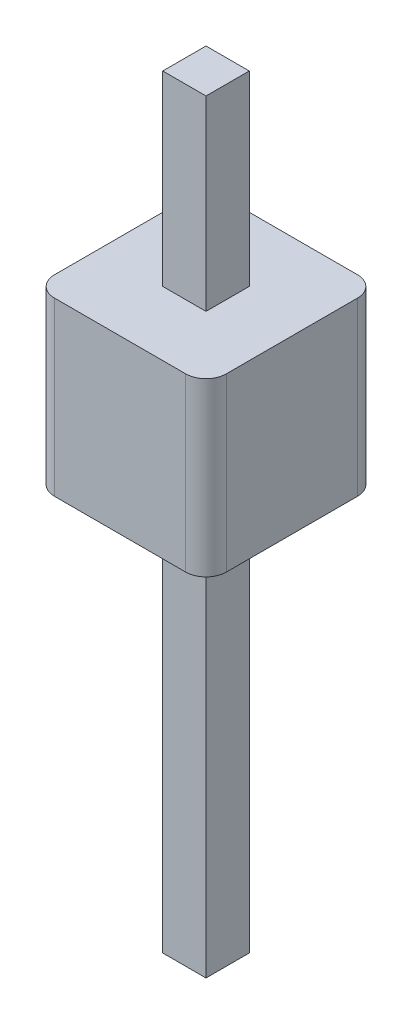
ISO-10303-21;
HEADER;
FILE_DESCRIPTION(('STEP AP214'),'2;1');
FILE_NAME('part.step','',(''),(''),'','','');
FILE_SCHEMA(('AUTOMOTIVE_DESIGN { 1 0 10303 214 1 1 1 1 }'));
ENDSEC;
DATA;
#1=APPLICATION_CONTEXT('core data for automotive mechanical design processes');
#2=APPLICATION_PROTOCOL_DEFINITION('international standard','automotive_design',2000,#1);
#3=PRODUCT_CONTEXT('',#1,'mechanical');
#4=PRODUCT('Part','Part','',(#3));
#5=PRODUCT_RELATED_PRODUCT_CATEGORY('part','',(#4));
#6=PRODUCT_DEFINITION_FORMATION('','',#4);
#7=PRODUCT_DEFINITION_CONTEXT('part definition',#1,'design');
#8=PRODUCT_DEFINITION('design','',#6,#7);
#9=PRODUCT_DEFINITION_SHAPE('','',#8);
#10=(LENGTH_UNIT() NAMED_UNIT(*) SI_UNIT(.MILLI.,.METRE.));
#11=(NAMED_UNIT(*) PLANE_ANGLE_UNIT() SI_UNIT($,.RADIAN.));
#12=(NAMED_UNIT(*) SI_UNIT($,.STERADIAN.) SOLID_ANGLE_UNIT());
#13=UNCERTAINTY_MEASURE_WITH_UNIT(LENGTH_MEASURE(1.E-05),#10,'distance_accuracy_value','');
#14=(GEOMETRIC_REPRESENTATION_CONTEXT(3) GLOBAL_UNCERTAINTY_ASSIGNED_CONTEXT((#13)) GLOBAL_UNIT_ASSIGNED_CONTEXT((#10,
#11,#12)) REPRESENTATION_CONTEXT('',''));
#15=CARTESIAN_POINT('',(0.,0.,0.));
#16=DIRECTION('',(0.,0.,1.));
#17=DIRECTION('',(1.,0.,0.));
#18=AXIS2_PLACEMENT_3D('',#15,#16,#17);
#19=CARTESIAN_POINT('',(-0.97,2.54,0.97));
#20=DIRECTION('',(0.,-1.,0.));
#21=DIRECTION('',(0.,0.,-1.));
#22=AXIS2_PLACEMENT_3D('',#19,#20,#21);
#23=PLANE('',#22);
#24=CARTESIAN_POINT('',(-0.97,2.54,0.97));
#25=DIRECTION('',(0.,1.,0.));
#26=DIRECTION('',(0.,0.,-1.));
#27=AXIS2_PLACEMENT_3D('',#24,#25,#26);
#28=CIRCLE('',#27,0.3);
#29=CARTESIAN_POINT('',(-1.27,2.54,0.97));
#30=VERTEX_POINT('',#29);
#31=CARTESIAN_POINT('',(-0.97,2.54,1.27));
#32=VERTEX_POINT('',#31);
#33=EDGE_CURVE('E216',#30,#32,#28,.T.);
#34=ORIENTED_EDGE('',*,*,#33,.T.);
#35=DIRECTION('',(1.,0.,0.));
#36=VECTOR('',#35,1.);
#37=CARTESIAN_POINT('',(0.970000000000001,2.54,1.27));
#38=LINE('',#37,#36);
#39=CARTESIAN_POINT('',(0.970000000000001,2.54,1.27));
#40=VERTEX_POINT('',#39);
#41=EDGE_CURVE('E219',#32,#40,#38,.T.);
#42=ORIENTED_EDGE('',*,*,#41,.T.);
#43=CARTESIAN_POINT('',(0.97,2.54,0.97));
#44=DIRECTION('',(0.,1.,0.));
#45=DIRECTION('',(0.,0.,1.));
#46=AXIS2_PLACEMENT_3D('',#43,#44,#45);
#47=CIRCLE('',#46,0.3);
#48=CARTESIAN_POINT('',(1.27,2.54,0.97));
#49=VERTEX_POINT('',#48);
#50=EDGE_CURVE('E222',#40,#49,#47,.T.);
#51=ORIENTED_EDGE('',*,*,#50,.T.);
#52=DIRECTION('',(0.,0.,-1.));
#53=VECTOR('',#52,1.);
#54=CARTESIAN_POINT('',(1.27,2.54,0.97));
#55=LINE('',#54,#53);
#56=CARTESIAN_POINT('',(1.27,2.54,-0.97));
#57=VERTEX_POINT('',#56);
#58=EDGE_CURVE('E224',#49,#57,#55,.T.);
#59=ORIENTED_EDGE('',*,*,#58,.T.);
#60=CARTESIAN_POINT('',(0.97,2.54,-0.97));
#61=DIRECTION('',(0.,1.,0.));
#62=DIRECTION('',(0.,0.,1.));
#63=AXIS2_PLACEMENT_3D('',#60,#61,#62);
#64=CIRCLE('',#63,0.3);
#65=CARTESIAN_POINT('',(0.97,2.54,-1.27));
#66=VERTEX_POINT('',#65);
#67=EDGE_CURVE('E226',#57,#66,#64,.T.);
#68=ORIENTED_EDGE('',*,*,#67,.T.);
#69=DIRECTION('',(-1.,0.,0.));
#70=VECTOR('',#69,1.);
#71=CARTESIAN_POINT('',(0.97,2.54,-1.27));
#72=LINE('',#71,#70);
#73=CARTESIAN_POINT('',(-0.969999999999998,2.54,-1.27));
#74=VERTEX_POINT('',#73);
#75=EDGE_CURVE('E228',#66,#74,#72,.T.);
#76=ORIENTED_EDGE('',*,*,#75,.T.);
#77=CARTESIAN_POINT('',(-0.97,2.54,-0.97));
#78=DIRECTION('',(0.,1.,0.));
#79=DIRECTION('',(0.,0.,1.));
#80=AXIS2_PLACEMENT_3D('',#77,#78,#79);
#81=CIRCLE('',#80,0.3);
#82=CARTESIAN_POINT('',(-1.27,2.54,-0.969999999999998));
#83=VERTEX_POINT('',#82);
#84=EDGE_CURVE('E230',#74,#83,#81,.T.);
#85=ORIENTED_EDGE('',*,*,#84,.T.);
#86=DIRECTION('',(0.,0.,1.));
#87=VECTOR('',#86,1.);
#88=CARTESIAN_POINT('',(-1.27,2.54,0.97));
#89=LINE('',#88,#87);
#90=EDGE_CURVE('E232',#83,#30,#89,.T.);
#91=ORIENTED_EDGE('',*,*,#90,.T.);
#92=EDGE_LOOP('',(#34,#42,#51,#59,#68,#76,#85,#91));
#93=FACE_BOUND('',#92,.T.);
#94=DIRECTION('',(0.,0.,1.));
#95=VECTOR('',#94,1.);
#96=CARTESIAN_POINT('',(-0.32,2.54,0.32));
#97=LINE('',#96,#95);
#98=CARTESIAN_POINT('',(-0.32,2.54,-0.32));
#99=VERTEX_POINT('',#98);
#100=CARTESIAN_POINT('',(-0.32,2.54,0.32));
#101=VERTEX_POINT('',#100);
#102=EDGE_CURVE('E196',#99,#101,#97,.T.);
#103=ORIENTED_EDGE('',*,*,#102,.F.);
#104=DIRECTION('',(-1.,0.,0.));
#105=VECTOR('',#104,1.);
#106=CARTESIAN_POINT('',(0.32,2.54,-0.32));
#107=LINE('',#106,#105);
#108=CARTESIAN_POINT('',(0.32,2.54,-0.32));
#109=VERTEX_POINT('',#108);
#110=EDGE_CURVE('E49',#109,#99,#107,.T.);
#111=ORIENTED_EDGE('',*,*,#110,.F.);
#112=DIRECTION('',(0.,0.,-1.));
#113=VECTOR('',#112,1.);
#114=CARTESIAN_POINT('',(0.32,2.54,0.32));
#115=LINE('',#114,#113);
#116=CARTESIAN_POINT('',(0.32,2.54,0.32));
#117=VERTEX_POINT('',#116);
#118=EDGE_CURVE('E155',#117,#109,#115,.T.);
#119=ORIENTED_EDGE('',*,*,#118,.F.);
#120=DIRECTION('',(1.,0.,0.));
#121=VECTOR('',#120,1.);
#122=CARTESIAN_POINT('',(0.32,2.54,0.32));
#123=LINE('',#122,#121);
#124=EDGE_CURVE('E199',#101,#117,#123,.T.);
#125=ORIENTED_EDGE('',*,*,#124,.F.);
#126=EDGE_LOOP('',(#103,#111,#119,#125));
#127=FACE_BOUND('',#126,.T.);
#128=ADVANCED_FACE('F34',(#93,#127),#23,.F.);
#129=CARTESIAN_POINT('',(-0.97,0.,0.97));
#130=DIRECTION('',(0.,-1.,0.));
#131=DIRECTION('',(0.,0.,-1.));
#132=AXIS2_PLACEMENT_3D('',#129,#130,#131);
#133=PLANE('',#132);
#134=CARTESIAN_POINT('',(-0.97,0.,0.97));
#135=DIRECTION('',(0.,1.,0.));
#136=DIRECTION('',(0.,0.,-1.));
#137=AXIS2_PLACEMENT_3D('',#134,#135,#136);
#138=CIRCLE('',#137,0.3);
#139=CARTESIAN_POINT('',(-1.27,0.,0.97));
#140=VERTEX_POINT('',#139);
#141=CARTESIAN_POINT('',(-0.97,0.,1.27));
#142=VERTEX_POINT('',#141);
#143=EDGE_CURVE('E205',#140,#142,#138,.T.);
#144=ORIENTED_EDGE('',*,*,#143,.F.);
#145=DIRECTION('',(0.,0.,1.));
#146=VECTOR('',#145,1.);
#147=CARTESIAN_POINT('',(-1.27,0.,0.97));
#148=LINE('',#147,#146);
#149=CARTESIAN_POINT('',(-1.27,0.,-0.969999999999998));
#150=VERTEX_POINT('',#149);
#151=EDGE_CURVE('E220',#150,#140,#148,.T.);
#152=ORIENTED_EDGE('',*,*,#151,.F.);
#153=CARTESIAN_POINT('',(-0.97,0.,-0.97));
#154=DIRECTION('',(0.,1.,0.));
#155=DIRECTION('',(0.,0.,1.));
#156=AXIS2_PLACEMENT_3D('',#153,#154,#155);
#157=CIRCLE('',#156,0.3);
#158=CARTESIAN_POINT('',(-0.969999999999998,0.,-1.27));
#159=VERTEX_POINT('',#158);
#160=EDGE_CURVE('E247',#159,#150,#157,.T.);
#161=ORIENTED_EDGE('',*,*,#160,.F.);
#162=DIRECTION('',(-1.,0.,0.));
#163=VECTOR('',#162,1.);
#164=CARTESIAN_POINT('',(0.97,0.,-1.27));
#165=LINE('',#164,#163);
#166=CARTESIAN_POINT('',(0.97,0.,-1.27));
#167=VERTEX_POINT('',#166);
#168=EDGE_CURVE('E245',#167,#159,#165,.T.);
#169=ORIENTED_EDGE('',*,*,#168,.F.);
#170=CARTESIAN_POINT('',(0.97,0.,-0.97));
#171=DIRECTION('',(0.,1.,0.));
#172=DIRECTION('',(0.,0.,1.));
#173=AXIS2_PLACEMENT_3D('',#170,#171,#172);
#174=CIRCLE('',#173,0.3);
#175=CARTESIAN_POINT('',(1.27,0.,-0.97));
#176=VERTEX_POINT('',#175);
#177=EDGE_CURVE('E243',#176,#167,#174,.T.);
#178=ORIENTED_EDGE('',*,*,#177,.F.);
#179=DIRECTION('',(0.,0.,-1.));
#180=VECTOR('',#179,1.);
#181=CARTESIAN_POINT('',(1.27,0.,0.97));
#182=LINE('',#181,#180);
#183=CARTESIAN_POINT('',(1.27,0.,0.97));
#184=VERTEX_POINT('',#183);
#185=EDGE_CURVE('E241',#184,#176,#182,.T.);
#186=ORIENTED_EDGE('',*,*,#185,.F.);
#187=CARTESIAN_POINT('',(0.97,0.,0.97));
#188=DIRECTION('',(0.,1.,0.));
#189=DIRECTION('',(0.,0.,1.));
#190=AXIS2_PLACEMENT_3D('',#187,#188,#189);
#191=CIRCLE('',#190,0.3);
#192=CARTESIAN_POINT('',(0.970000000000001,0.,1.27));
#193=VERTEX_POINT('',#192);
#194=EDGE_CURVE('E239',#193,#184,#191,.T.);
#195=ORIENTED_EDGE('',*,*,#194,.F.);
#196=DIRECTION('',(1.,0.,0.));
#197=VECTOR('',#196,1.);
#198=CARTESIAN_POINT('',(0.970000000000001,0.,1.27));
#199=LINE('',#198,#197);
#200=EDGE_CURVE('E237',#142,#193,#199,.T.);
#201=ORIENTED_EDGE('',*,*,#200,.F.);
#202=EDGE_LOOP('',(#144,#152,#161,#169,#178,#186,#195,#201));
#203=FACE_BOUND('',#202,.T.);
#204=DIRECTION('',(-1.,0.,0.));
#205=VECTOR('',#204,1.);
#206=CARTESIAN_POINT('',(0.32,0.,-0.32));
#207=LINE('',#206,#205);
#208=CARTESIAN_POINT('',(0.32,0.,-0.32));
#209=VERTEX_POINT('',#208);
#210=CARTESIAN_POINT('',(-0.32,0.,-0.32));
#211=VERTEX_POINT('',#210);
#212=EDGE_CURVE('E200',#209,#211,#207,.T.);
#213=ORIENTED_EDGE('',*,*,#212,.T.);
#214=DIRECTION('',(0.,0.,1.));
#215=VECTOR('',#214,1.);
#216=CARTESIAN_POINT('',(-0.32,0.,0.32));
#217=LINE('',#216,#215);
#218=CARTESIAN_POINT('',(-0.32,0.,0.32));
#219=VERTEX_POINT('',#218);
#220=EDGE_CURVE('E188',#211,#219,#217,.T.);
#221=ORIENTED_EDGE('',*,*,#220,.T.);
#222=DIRECTION('',(1.,0.,0.));
#223=VECTOR('',#222,1.);
#224=CARTESIAN_POINT('',(0.32,0.,0.32));
#225=LINE('',#224,#223);
#226=CARTESIAN_POINT('',(0.32,0.,0.32));
#227=VERTEX_POINT('',#226);
#228=EDGE_CURVE('E208',#219,#227,#225,.T.);
#229=ORIENTED_EDGE('',*,*,#228,.T.);
#230=DIRECTION('',(0.,0.,-1.));
#231=VECTOR('',#230,1.);
#232=CARTESIAN_POINT('',(0.32,0.,0.32));
#233=LINE('',#232,#231);
#234=EDGE_CURVE('E211',#227,#209,#233,.T.);
#235=ORIENTED_EDGE('',*,*,#234,.T.);
#236=EDGE_LOOP('',(#213,#221,#229,#235));
#237=FACE_BOUND('',#236,.T.);
#238=ADVANCED_FACE('F277',(#203,#237),#133,.T.);
#239=CARTESIAN_POINT('',(-0.97,2.54,0.97));
#240=DIRECTION('',(0.,-1.,0.));
#241=DIRECTION('',(0.,0.,-1.));
#242=AXIS2_PLACEMENT_3D('',#239,#240,#241);
#243=CYLINDRICAL_SURFACE('',#242,0.3);
#244=ORIENTED_EDGE('',*,*,#143,.T.);
#245=DIRECTION('',(0.,-1.,0.));
#246=VECTOR('',#245,1.);
#247=CARTESIAN_POINT('',(-0.97,2.54,1.27));
#248=LINE('',#247,#246);
#249=EDGE_CURVE('E11',#32,#142,#248,.T.);
#250=ORIENTED_EDGE('',*,*,#249,.F.);
#251=ORIENTED_EDGE('',*,*,#33,.F.);
#252=DIRECTION('',(0.,-1.,0.));
#253=VECTOR('',#252,1.);
#254=CARTESIAN_POINT('',(-1.27,2.54,0.97));
#255=LINE('',#254,#253);
#256=EDGE_CURVE('E234',#30,#140,#255,.T.);
#257=ORIENTED_EDGE('',*,*,#256,.T.);
#258=EDGE_LOOP('',(#244,#250,#251,#257));
#259=FACE_BOUND('',#258,.T.);
#260=ADVANCED_FACE('F36',(#259),#243,.T.);
#261=CARTESIAN_POINT('',(0.970000000000001,2.54,1.27));
#262=DIRECTION('',(0.,0.,-1.));
#263=DIRECTION('',(-1.,0.,0.));
#264=AXIS2_PLACEMENT_3D('',#261,#262,#263);
#265=PLANE('',#264);
#266=ORIENTED_EDGE('',*,*,#200,.T.);
#267=DIRECTION('',(0.,-1.,0.));
#268=VECTOR('',#267,1.);
#269=CARTESIAN_POINT('',(0.970000000000001,2.54,1.27));
#270=LINE('',#269,#268);
#271=EDGE_CURVE('E42',#40,#193,#270,.T.);
#272=ORIENTED_EDGE('',*,*,#271,.F.);
#273=ORIENTED_EDGE('',*,*,#41,.F.);
#274=ORIENTED_EDGE('',*,*,#249,.T.);
#275=EDGE_LOOP('',(#266,#272,#273,#274));
#276=FACE_BOUND('',#275,.T.);
#277=ADVANCED_FACE('F294',(#276),#265,.F.);
#278=CARTESIAN_POINT('',(0.97,2.54,0.97));
#279=DIRECTION('',(0.,-1.,0.));
#280=DIRECTION('',(0.,0.,-1.));
#281=AXIS2_PLACEMENT_3D('',#278,#279,#280);
#282=CYLINDRICAL_SURFACE('',#281,0.3);
#283=ORIENTED_EDGE('',*,*,#194,.T.);
#284=DIRECTION('',(0.,-1.,0.));
#285=VECTOR('',#284,1.);
#286=CARTESIAN_POINT('',(1.27,2.54,0.97));
#287=LINE('',#286,#285);
#288=EDGE_CURVE('E264',#49,#184,#287,.T.);
#289=ORIENTED_EDGE('',*,*,#288,.F.);
#290=ORIENTED_EDGE('',*,*,#50,.F.);
#291=ORIENTED_EDGE('',*,*,#271,.T.);
#292=EDGE_LOOP('',(#283,#289,#290,#291));
#293=FACE_BOUND('',#292,.T.);
#294=ADVANCED_FACE('F271',(#293),#282,.T.);
#295=CARTESIAN_POINT('',(1.27,2.54,0.97));
#296=DIRECTION('',(-1.,0.,0.));
#297=DIRECTION('',(0.,0.,1.));
#298=AXIS2_PLACEMENT_3D('',#295,#296,#297);
#299=PLANE('',#298);
#300=ORIENTED_EDGE('',*,*,#185,.T.);
#301=DIRECTION('',(0.,-1.,0.));
#302=VECTOR('',#301,1.);
#303=CARTESIAN_POINT('',(1.27,2.54,-0.97));
#304=LINE('',#303,#302);
#305=EDGE_CURVE('E261',#57,#176,#304,.T.);
#306=ORIENTED_EDGE('',*,*,#305,.F.);
#307=ORIENTED_EDGE('',*,*,#58,.F.);
#308=ORIENTED_EDGE('',*,*,#288,.T.);
#309=EDGE_LOOP('',(#300,#306,#307,#308));
#310=FACE_BOUND('',#309,.T.);
#311=ADVANCED_FACE('F283',(#310),#299,.F.);
#312=CARTESIAN_POINT('',(0.97,2.54,-0.97));
#313=DIRECTION('',(0.,-1.,0.));
#314=DIRECTION('',(0.,0.,-1.));
#315=AXIS2_PLACEMENT_3D('',#312,#313,#314);
#316=CYLINDRICAL_SURFACE('',#315,0.3);
#317=ORIENTED_EDGE('',*,*,#177,.T.);
#318=DIRECTION('',(0.,-1.,0.));
#319=VECTOR('',#318,1.);
#320=CARTESIAN_POINT('',(0.97,2.54,-1.27));
#321=LINE('',#320,#319);
#322=EDGE_CURVE('E258',#66,#167,#321,.T.);
#323=ORIENTED_EDGE('',*,*,#322,.F.);
#324=ORIENTED_EDGE('',*,*,#67,.F.);
#325=ORIENTED_EDGE('',*,*,#305,.T.);
#326=EDGE_LOOP('',(#317,#323,#324,#325));
#327=FACE_BOUND('',#326,.T.);
#328=ADVANCED_FACE('F287',(#327),#316,.T.);
#329=CARTESIAN_POINT('',(0.97,2.54,-1.27));
#330=DIRECTION('',(0.,0.,1.));
#331=DIRECTION('',(1.,0.,0.));
#332=AXIS2_PLACEMENT_3D('',#329,#330,#331);
#333=PLANE('',#332);
#334=ORIENTED_EDGE('',*,*,#168,.T.);
#335=DIRECTION('',(0.,-1.,0.));
#336=VECTOR('',#335,1.);
#337=CARTESIAN_POINT('',(-0.969999999999998,2.54,-1.27));
#338=LINE('',#337,#336);
#339=EDGE_CURVE('E255',#74,#159,#338,.T.);
#340=ORIENTED_EDGE('',*,*,#339,.F.);
#341=ORIENTED_EDGE('',*,*,#75,.F.);
#342=ORIENTED_EDGE('',*,*,#322,.T.);
#343=EDGE_LOOP('',(#334,#340,#341,#342));
#344=FACE_BOUND('',#343,.T.);
#345=ADVANCED_FACE('F307',(#344),#333,.F.);
#346=CARTESIAN_POINT('',(-0.97,2.54,-0.97));
#347=DIRECTION('',(0.,-1.,0.));
#348=DIRECTION('',(0.,0.,-1.));
#349=AXIS2_PLACEMENT_3D('',#346,#347,#348);
#350=CYLINDRICAL_SURFACE('',#349,0.3);
#351=ORIENTED_EDGE('',*,*,#160,.T.);
#352=DIRECTION('',(0.,-1.,0.));
#353=VECTOR('',#352,1.);
#354=CARTESIAN_POINT('',(-1.27,2.54,-0.969999999999998));
#355=LINE('',#354,#353);
#356=EDGE_CURVE('E252',#83,#150,#355,.T.);
#357=ORIENTED_EDGE('',*,*,#356,.F.);
#358=ORIENTED_EDGE('',*,*,#84,.F.);
#359=ORIENTED_EDGE('',*,*,#339,.T.);
#360=EDGE_LOOP('',(#351,#357,#358,#359));
#361=FACE_BOUND('',#360,.T.);
#362=ADVANCED_FACE('F305',(#361),#350,.T.);
#363=CARTESIAN_POINT('',(-1.27,2.54,0.97));
#364=DIRECTION('',(1.,0.,0.));
#365=DIRECTION('',(0.,0.,-1.));
#366=AXIS2_PLACEMENT_3D('',#363,#364,#365);
#367=PLANE('',#366);
#368=ORIENTED_EDGE('',*,*,#151,.T.);
#369=ORIENTED_EDGE('',*,*,#256,.F.);
#370=ORIENTED_EDGE('',*,*,#90,.F.);
#371=ORIENTED_EDGE('',*,*,#356,.T.);
#372=EDGE_LOOP('',(#368,#369,#370,#371));
#373=FACE_BOUND('',#372,.T.);
#374=ADVANCED_FACE('F300',(#373),#367,.F.);
#375=CARTESIAN_POINT('',(0.,-6.,0.));
#376=DIRECTION('',(0.,1.,0.));
#377=DIRECTION('',(0.,0.,1.));
#378=AXIS2_PLACEMENT_3D('',#375,#376,#377);
#379=PLANE('',#378);
#380=DIRECTION('',(0.,0.,-1.));
#381=VECTOR('',#380,1.);
#382=CARTESIAN_POINT('',(0.32,-6.,0.32));
#383=LINE('',#382,#381);
#384=CARTESIAN_POINT('',(0.32,-6.,0.32));
#385=VERTEX_POINT('',#384);
#386=CARTESIAN_POINT('',(0.32,-6.,-0.32));
#387=VERTEX_POINT('',#386);
#388=EDGE_CURVE('E177',#385,#387,#383,.T.);
#389=ORIENTED_EDGE('',*,*,#388,.F.);
#390=DIRECTION('',(-1.,0.,0.));
#391=VECTOR('',#390,1.);
#392=CARTESIAN_POINT('',(0.32,-6.,0.32));
#393=LINE('',#392,#391);
#394=CARTESIAN_POINT('',(-0.32,-6.,0.32));
#395=VERTEX_POINT('',#394);
#396=EDGE_CURVE('E158',#385,#395,#393,.T.);
#397=ORIENTED_EDGE('',*,*,#396,.T.);
#398=DIRECTION('',(0.,0.,-1.));
#399=VECTOR('',#398,1.);
#400=CARTESIAN_POINT('',(-0.32,-6.,0.32));
#401=LINE('',#400,#399);
#402=CARTESIAN_POINT('',(-0.32,-6.,-0.32));
#403=VERTEX_POINT('',#402);
#404=EDGE_CURVE('E182',#395,#403,#401,.T.);
#405=ORIENTED_EDGE('',*,*,#404,.T.);
#406=DIRECTION('',(-1.,0.,0.));
#407=VECTOR('',#406,1.);
#408=CARTESIAN_POINT('',(0.32,-6.,-0.32));
#409=LINE('',#408,#407);
#410=EDGE_CURVE('E180',#387,#403,#409,.T.);
#411=ORIENTED_EDGE('',*,*,#410,.F.);
#412=EDGE_LOOP('',(#389,#397,#405,#411));
#413=FACE_BOUND('',#412,.T.);
#414=ADVANCED_FACE('F327',(#413),#379,.F.);
#415=CARTESIAN_POINT('',(0.32,-6.,-0.32));
#416=DIRECTION('',(0.,0.,-1.));
#417=DIRECTION('',(-1.,0.,0.));
#418=AXIS2_PLACEMENT_3D('',#415,#416,#417);
#419=PLANE('',#418);
#420=DIRECTION('',(0.,1.,0.));
#421=VECTOR('',#420,1.);
#422=CARTESIAN_POINT('',(-0.32,-6.,-0.32));
#423=LINE('',#422,#421);
#424=EDGE_CURVE('E57',#403,#211,#423,.T.);
#425=ORIENTED_EDGE('',*,*,#424,.T.);
#426=ORIENTED_EDGE('',*,*,#212,.F.);
#427=DIRECTION('',(0.,1.,0.));
#428=VECTOR('',#427,1.);
#429=CARTESIAN_POINT('',(0.32,-6.,-0.32));
#430=LINE('',#429,#428);
#431=EDGE_CURVE('E157',#387,#209,#430,.T.);
#432=ORIENTED_EDGE('',*,*,#431,.F.);
#433=ORIENTED_EDGE('',*,*,#410,.T.);
#434=EDGE_LOOP('',(#425,#426,#432,#433));
#435=FACE_BOUND('',#434,.T.);
#436=ADVANCED_FACE('F331',(#435),#419,.T.);
#437=CARTESIAN_POINT('',(-0.32,-6.,0.32));
#438=DIRECTION('',(1.,0.,0.));
#439=DIRECTION('',(0.,0.,-1.));
#440=AXIS2_PLACEMENT_3D('',#437,#438,#439);
#441=PLANE('',#440);
#442=ORIENTED_EDGE('',*,*,#220,.F.);
#443=ORIENTED_EDGE('',*,*,#424,.F.);
#444=ORIENTED_EDGE('',*,*,#404,.F.);
#445=DIRECTION('',(0.,1.,0.));
#446=VECTOR('',#445,1.);
#447=CARTESIAN_POINT('',(-0.32,-6.,0.32));
#448=LINE('',#447,#446);
#449=EDGE_CURVE('E190',#395,#219,#448,.T.);
#450=ORIENTED_EDGE('',*,*,#449,.T.);
#451=EDGE_LOOP('',(#442,#443,#444,#450));
#452=FACE_BOUND('',#451,.T.);
#453=ADVANCED_FACE('F337',(#452),#441,.F.);
#454=CARTESIAN_POINT('',(0.32,-6.,0.32));
#455=DIRECTION('',(0.,0.,-1.));
#456=DIRECTION('',(-1.,0.,0.));
#457=AXIS2_PLACEMENT_3D('',#454,#455,#456);
#458=PLANE('',#457);
#459=ORIENTED_EDGE('',*,*,#228,.F.);
#460=ORIENTED_EDGE('',*,*,#449,.F.);
#461=ORIENTED_EDGE('',*,*,#396,.F.);
#462=DIRECTION('',(0.,1.,0.));
#463=VECTOR('',#462,1.);
#464=CARTESIAN_POINT('',(0.32,-6.,0.32));
#465=LINE('',#464,#463);
#466=EDGE_CURVE('E185',#385,#227,#465,.T.);
#467=ORIENTED_EDGE('',*,*,#466,.T.);
#468=EDGE_LOOP('',(#459,#460,#461,#467));
#469=FACE_BOUND('',#468,.T.);
#470=ADVANCED_FACE('F341',(#469),#458,.F.);
#471=CARTESIAN_POINT('',(0.32,-6.,0.32));
#472=DIRECTION('',(1.,0.,0.));
#473=DIRECTION('',(0.,0.,-1.));
#474=AXIS2_PLACEMENT_3D('',#471,#472,#473);
#475=PLANE('',#474);
#476=ORIENTED_EDGE('',*,*,#431,.T.);
#477=ORIENTED_EDGE('',*,*,#234,.F.);
#478=ORIENTED_EDGE('',*,*,#466,.F.);
#479=ORIENTED_EDGE('',*,*,#388,.T.);
#480=EDGE_LOOP('',(#476,#477,#478,#479));
#481=FACE_BOUND('',#480,.T.);
#482=ADVANCED_FACE('F323',(#481),#475,.T.);
#483=CARTESIAN_POINT('',(-0.32,5.3,0.32));
#484=VERTEX_POINT('',#483);
#485=EDGE_CURVE('E193',#101,#484,#448,.T.);
#486=ORIENTED_EDGE('',*,*,#485,.F.);
#487=ORIENTED_EDGE('',*,*,#124,.T.);
#488=CARTESIAN_POINT('',(0.32,5.3,0.32));
#489=VERTEX_POINT('',#488);
#490=EDGE_CURVE('E189',#117,#489,#465,.T.);
#491=ORIENTED_EDGE('',*,*,#490,.T.);
#492=DIRECTION('',(-1.,0.,0.));
#493=VECTOR('',#492,1.);
#494=CARTESIAN_POINT('',(0.32,5.3,0.32));
#495=LINE('',#494,#493);
#496=EDGE_CURVE('E172',#489,#484,#495,.T.);
#497=ORIENTED_EDGE('',*,*,#496,.T.);
#498=EDGE_LOOP('',(#486,#487,#491,#497));
#499=FACE_BOUND('',#498,.T.);
#500=ADVANCED_FACE('F345',(#499),#458,.F.);
#501=ORIENTED_EDGE('',*,*,#110,.T.);
#502=CARTESIAN_POINT('',(-0.32,5.3,-0.32));
#503=VERTEX_POINT('',#502);
#504=EDGE_CURVE('E164',#99,#503,#423,.T.);
#505=ORIENTED_EDGE('',*,*,#504,.T.);
#506=DIRECTION('',(-1.,0.,0.));
#507=VECTOR('',#506,1.);
#508=CARTESIAN_POINT('',(0.32,5.3,-0.32));
#509=LINE('',#508,#507);
#510=CARTESIAN_POINT('',(0.32,5.3,-0.32));
#511=VERTEX_POINT('',#510);
#512=EDGE_CURVE('E161',#511,#503,#509,.T.);
#513=ORIENTED_EDGE('',*,*,#512,.F.);
#514=EDGE_CURVE('E148',#109,#511,#430,.T.);
#515=ORIENTED_EDGE('',*,*,#514,.F.);
#516=EDGE_LOOP('',(#501,#505,#513,#515));
#517=FACE_BOUND('',#516,.T.);
#518=ADVANCED_FACE('F162',(#517),#419,.T.);
#519=ORIENTED_EDGE('',*,*,#118,.T.);
#520=ORIENTED_EDGE('',*,*,#514,.T.);
#521=DIRECTION('',(0.,0.,-1.));
#522=VECTOR('',#521,1.);
#523=CARTESIAN_POINT('',(0.32,5.3,0.32));
#524=LINE('',#523,#522);
#525=EDGE_CURVE('E153',#489,#511,#524,.T.);
#526=ORIENTED_EDGE('',*,*,#525,.F.);
#527=ORIENTED_EDGE('',*,*,#490,.F.);
#528=EDGE_LOOP('',(#519,#520,#526,#527));
#529=FACE_BOUND('',#528,.T.);
#530=ADVANCED_FACE('F150',(#529),#475,.T.);
#531=ORIENTED_EDGE('',*,*,#504,.F.);
#532=ORIENTED_EDGE('',*,*,#102,.T.);
#533=ORIENTED_EDGE('',*,*,#485,.T.);
#534=DIRECTION('',(0.,0.,-1.));
#535=VECTOR('',#534,1.);
#536=CARTESIAN_POINT('',(-0.32,5.3,0.32));
#537=LINE('',#536,#535);
#538=EDGE_CURVE('E168',#484,#503,#537,.T.);
#539=ORIENTED_EDGE('',*,*,#538,.T.);
#540=EDGE_LOOP('',(#531,#532,#533,#539));
#541=FACE_BOUND('',#540,.T.);
#542=ADVANCED_FACE('F348',(#541),#441,.F.);
#543=CARTESIAN_POINT('',(0.,5.3,0.));
#544=DIRECTION('',(0.,1.,0.));
#545=DIRECTION('',(0.,0.,1.));
#546=AXIS2_PLACEMENT_3D('',#543,#544,#545);
#547=PLANE('',#546);
#548=ORIENTED_EDGE('',*,*,#525,.T.);
#549=ORIENTED_EDGE('',*,*,#512,.T.);
#550=ORIENTED_EDGE('',*,*,#538,.F.);
#551=ORIENTED_EDGE('',*,*,#496,.F.);
#552=EDGE_LOOP('',(#548,#549,#550,#551));
#553=FACE_BOUND('',#552,.T.);
#554=ADVANCED_FACE('F170',(#553),#547,.T.);
#555=CLOSED_SHELL('',(#128,#238,#260,#277,#294,#311,#328,#345,#362,#374,#414,#436,#453,#470,
#482,#500,#518,#530,#542,#554));
#556=MANIFOLD_SOLID_BREP('B2',#555);
#557=ADVANCED_BREP_SHAPE_REPRESENTATION('',(#18,#556),#14);
#558=SHAPE_DEFINITION_REPRESENTATION(#9,#557);
ENDSEC;
END-ISO-10303-21;
